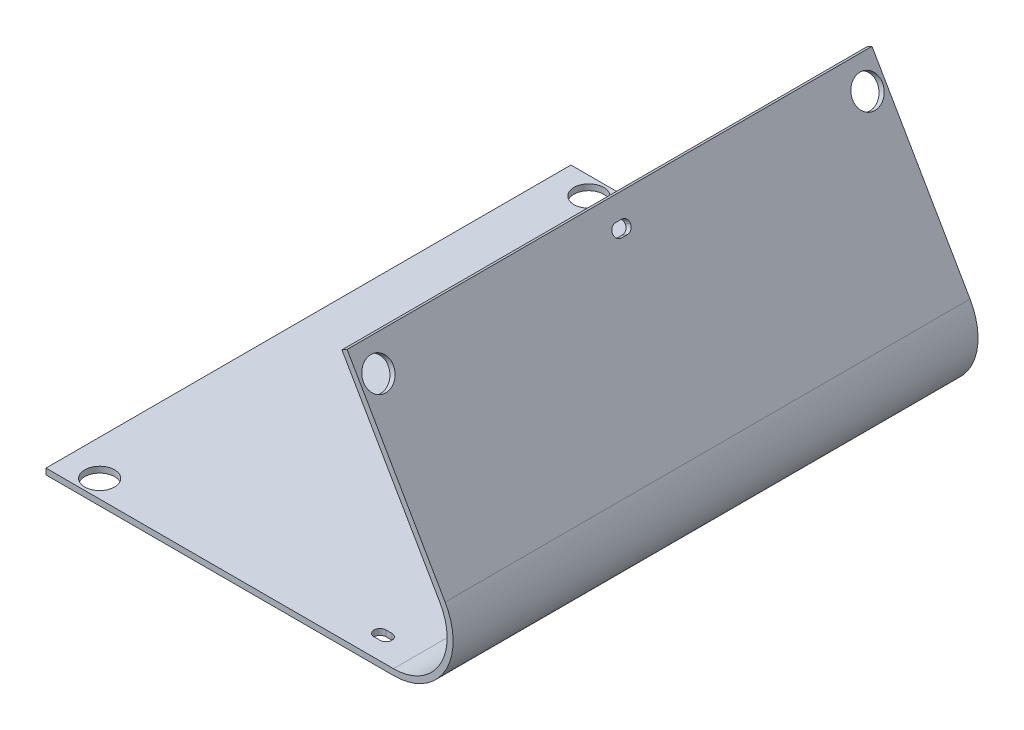
ISO-10303-21;
HEADER;
FILE_DESCRIPTION(('STEP AP214'),'2;1');
FILE_NAME('part.step','',(''),(''),'','','');
FILE_SCHEMA(('AUTOMOTIVE_DESIGN { 1 0 10303 214 1 1 1 1 }'));
ENDSEC;
DATA;
#1=APPLICATION_CONTEXT('core data for automotive mechanical design processes');
#2=APPLICATION_PROTOCOL_DEFINITION('international standard','automotive_design',2000,#1);
#3=PRODUCT_CONTEXT('',#1,'mechanical');
#4=PRODUCT('Part','Part','',(#3));
#5=PRODUCT_RELATED_PRODUCT_CATEGORY('part','',(#4));
#6=PRODUCT_DEFINITION_FORMATION('','',#4);
#7=PRODUCT_DEFINITION_CONTEXT('part definition',#1,'design');
#8=PRODUCT_DEFINITION('design','',#6,#7);
#9=PRODUCT_DEFINITION_SHAPE('','',#8);
#10=(LENGTH_UNIT() NAMED_UNIT(*) SI_UNIT(.MILLI.,.METRE.));
#11=(NAMED_UNIT(*) PLANE_ANGLE_UNIT() SI_UNIT($,.RADIAN.));
#12=(NAMED_UNIT(*) SI_UNIT($,.STERADIAN.) SOLID_ANGLE_UNIT());
#13=UNCERTAINTY_MEASURE_WITH_UNIT(LENGTH_MEASURE(1.E-05),#10,'distance_accuracy_value','');
#14=(GEOMETRIC_REPRESENTATION_CONTEXT(3) GLOBAL_UNCERTAINTY_ASSIGNED_CONTEXT((#13)) GLOBAL_UNIT_ASSIGNED_CONTEXT((#10,
#11,#12)) REPRESENTATION_CONTEXT('',''));
#15=CARTESIAN_POINT('',(0.,0.,0.));
#16=DIRECTION('',(0.,0.,1.));
#17=DIRECTION('',(1.,0.,0.));
#18=AXIS2_PLACEMENT_3D('',#15,#16,#17);
#19=CARTESIAN_POINT('',(-29.125,1.,88.));
#20=DIRECTION('',(1.,0.,0.));
#21=DIRECTION('',(0.,0.,-1.));
#22=AXIS2_PLACEMENT_3D('',#19,#20,#21);
#23=PLANE('',#22);
#24=DIRECTION('',(0.,-1.,0.));
#25=VECTOR('',#24,1.);
#26=CARTESIAN_POINT('',(-29.125,1.,0.));
#27=LINE('',#26,#25);
#28=CARTESIAN_POINT('',(-29.125,1.,0.));
#29=VERTEX_POINT('',#28);
#30=CARTESIAN_POINT('',(-29.125,0.,0.));
#31=VERTEX_POINT('',#30);
#32=EDGE_CURVE('E230',#29,#31,#27,.T.);
#33=ORIENTED_EDGE('',*,*,#32,.T.);
#34=DIRECTION('',(0.,0.,-1.));
#35=VECTOR('',#34,1.);
#36=CARTESIAN_POINT('',(-29.125,0.,88.));
#37=LINE('',#36,#35);
#38=CARTESIAN_POINT('',(-29.125,0.,88.));
#39=VERTEX_POINT('',#38);
#40=EDGE_CURVE('E211',#39,#31,#37,.T.);
#41=ORIENTED_EDGE('',*,*,#40,.F.);
#42=DIRECTION('',(0.,-1.,0.));
#43=VECTOR('',#42,1.);
#44=CARTESIAN_POINT('',(-29.125,1.,88.));
#45=LINE('',#44,#43);
#46=CARTESIAN_POINT('',(-29.125,1.,88.));
#47=VERTEX_POINT('',#46);
#48=EDGE_CURVE('E218',#47,#39,#45,.T.);
#49=ORIENTED_EDGE('',*,*,#48,.F.);
#50=DIRECTION('',(0.,0.,-1.));
#51=VECTOR('',#50,1.);
#52=CARTESIAN_POINT('',(-29.125,1.,88.));
#53=LINE('',#52,#51);
#54=EDGE_CURVE('E411',#47,#29,#53,.T.);
#55=ORIENTED_EDGE('',*,*,#54,.T.);
#56=EDGE_LOOP('',(#33,#41,#49,#55));
#57=FACE_BOUND('',#56,.T.);
#58=ADVANCED_FACE('F33',(#57),#23,.F.);
#59=CARTESIAN_POINT('',(-29.125,0.,88.));
#60=DIRECTION('',(0.,1.,0.));
#61=DIRECTION('',(0.,0.,1.));
#62=AXIS2_PLACEMENT_3D('',#59,#60,#61);
#63=PLANE('',#62);
#64=DIRECTION('',(1.,0.,0.));
#65=VECTOR('',#64,1.);
#66=CARTESIAN_POINT('',(21.875,0.,83.));
#67=LINE('',#66,#65);
#68=CARTESIAN_POINT('',(22.875,0.,83.));
#69=VERTEX_POINT('',#68);
#70=CARTESIAN_POINT('',(23.875,0.,83.));
#71=VERTEX_POINT('',#70);
#72=EDGE_CURVE('E366',#69,#71,#67,.T.);
#73=ORIENTED_EDGE('',*,*,#72,.F.);
#74=CARTESIAN_POINT('',(22.875,0.,84.));
#75=DIRECTION('',(0.,1.,0.));
#76=DIRECTION('',(0.,0.,1.));
#77=AXIS2_PLACEMENT_3D('',#74,#75,#76);
#78=CIRCLE('',#77,1.);
#79=CARTESIAN_POINT('',(21.875,0.,84.));
#80=VERTEX_POINT('',#79);
#81=EDGE_CURVE('E280',#69,#80,#78,.T.);
#82=ORIENTED_EDGE('',*,*,#81,.T.);
#83=CARTESIAN_POINT('',(22.875,0.,84.));
#84=DIRECTION('',(0.,1.,0.));
#85=DIRECTION('',(0.,0.,1.));
#86=AXIS2_PLACEMENT_3D('',#83,#84,#85);
#87=CIRCLE('',#86,1.);
#88=CARTESIAN_POINT('',(22.875,0.,85.));
#89=VERTEX_POINT('',#88);
#90=EDGE_CURVE('E268',#80,#89,#87,.T.);
#91=ORIENTED_EDGE('',*,*,#90,.T.);
#92=DIRECTION('',(-1.,0.,0.));
#93=VECTOR('',#92,1.);
#94=CARTESIAN_POINT('',(21.875,0.,85.));
#95=LINE('',#94,#93);
#96=CARTESIAN_POINT('',(23.875,0.,85.));
#97=VERTEX_POINT('',#96);
#98=EDGE_CURVE('E376',#97,#89,#95,.T.);
#99=ORIENTED_EDGE('',*,*,#98,.F.);
#100=CARTESIAN_POINT('',(23.875,0.,84.));
#101=DIRECTION('',(0.,1.,0.));
#102=DIRECTION('',(0.,0.,1.));
#103=AXIS2_PLACEMENT_3D('',#100,#101,#102);
#104=CIRCLE('',#103,1.);
#105=CARTESIAN_POINT('',(24.875,0.,84.));
#106=VERTEX_POINT('',#105);
#107=EDGE_CURVE('E276',#97,#106,#104,.T.);
#108=ORIENTED_EDGE('',*,*,#107,.T.);
#109=CARTESIAN_POINT('',(23.875,0.,84.));
#110=DIRECTION('',(0.,1.,0.));
#111=DIRECTION('',(0.,0.,1.));
#112=AXIS2_PLACEMENT_3D('',#109,#110,#111);
#113=CIRCLE('',#112,1.);
#114=EDGE_CURVE('E272',#106,#71,#113,.T.);
#115=ORIENTED_EDGE('',*,*,#114,.T.);
#116=EDGE_LOOP('',(#73,#82,#91,#99,#108,#115));
#117=FACE_BOUND('',#116,.T.);
#118=CARTESIAN_POINT('',(22.875,0.,4.));
#119=DIRECTION('',(0.,1.,0.));
#120=DIRECTION('',(0.,0.,1.));
#121=AXIS2_PLACEMENT_3D('',#118,#119,#120);
#122=CIRCLE('',#121,1.);
#123=CARTESIAN_POINT('',(22.875,0.,3.));
#124=VERTEX_POINT('',#123);
#125=CARTESIAN_POINT('',(21.875,0.,4.));
#126=VERTEX_POINT('',#125);
#127=EDGE_CURVE('E284',#124,#126,#122,.T.);
#128=ORIENTED_EDGE('',*,*,#127,.T.);
#129=CARTESIAN_POINT('',(22.875,0.,4.));
#130=DIRECTION('',(0.,1.,0.));
#131=DIRECTION('',(0.,0.,1.));
#132=AXIS2_PLACEMENT_3D('',#129,#130,#131);
#133=CIRCLE('',#132,1.);
#134=CARTESIAN_POINT('',(22.875,0.,5.));
#135=VERTEX_POINT('',#134);
#136=EDGE_CURVE('E288',#126,#135,#133,.T.);
#137=ORIENTED_EDGE('',*,*,#136,.T.);
#138=DIRECTION('',(-1.,0.,0.));
#139=VECTOR('',#138,1.);
#140=CARTESIAN_POINT('',(21.875,0.,5.));
#141=LINE('',#140,#139);
#142=CARTESIAN_POINT('',(23.875,0.,5.));
#143=VERTEX_POINT('',#142);
#144=EDGE_CURVE('E382',#143,#135,#141,.T.);
#145=ORIENTED_EDGE('',*,*,#144,.F.);
#146=CARTESIAN_POINT('',(23.875,0.,4.));
#147=DIRECTION('',(0.,1.,0.));
#148=DIRECTION('',(0.,0.,1.));
#149=AXIS2_PLACEMENT_3D('',#146,#147,#148);
#150=CIRCLE('',#149,1.);
#151=CARTESIAN_POINT('',(24.875,0.,4.));
#152=VERTEX_POINT('',#151);
#153=EDGE_CURVE('E296',#143,#152,#150,.T.);
#154=ORIENTED_EDGE('',*,*,#153,.T.);
#155=CARTESIAN_POINT('',(23.875,0.,4.));
#156=DIRECTION('',(0.,1.,0.));
#157=DIRECTION('',(0.,0.,1.));
#158=AXIS2_PLACEMENT_3D('',#155,#156,#157);
#159=CIRCLE('',#158,1.);
#160=CARTESIAN_POINT('',(23.875,0.,3.));
#161=VERTEX_POINT('',#160);
#162=EDGE_CURVE('E292',#152,#161,#159,.T.);
#163=ORIENTED_EDGE('',*,*,#162,.T.);
#164=DIRECTION('',(1.,0.,0.));
#165=VECTOR('',#164,1.);
#166=CARTESIAN_POINT('',(21.875,0.,3.));
#167=LINE('',#166,#165);
#168=EDGE_CURVE('E361',#124,#161,#167,.T.);
#169=ORIENTED_EDGE('',*,*,#168,.F.);
#170=EDGE_LOOP('',(#128,#137,#145,#154,#163,#169));
#171=FACE_BOUND('',#170,.T.);
#172=CARTESIAN_POINT('',(-23.125,0.,3.));
#173=DIRECTION('',(0.,1.,0.));
#174=DIRECTION('',(0.,0.,1.));
#175=AXIS2_PLACEMENT_3D('',#172,#173,#174);
#176=CIRCLE('',#175,2.49999999999999);
#177=CARTESIAN_POINT('',(-23.125,0.,5.49999999999999));
#178=VERTEX_POINT('',#177);
#179=EDGE_CURVE('E390',#178,#178,#176,.T.);
#180=ORIENTED_EDGE('',*,*,#179,.T.);
#181=EDGE_LOOP('',(#180));
#182=FACE_BOUND('',#181,.T.);
#183=CARTESIAN_POINT('',(-23.125,0.,85.));
#184=DIRECTION('',(0.,1.,0.));
#185=DIRECTION('',(0.,0.,-1.));
#186=AXIS2_PLACEMENT_3D('',#183,#184,#185);
#187=CIRCLE('',#186,2.5);
#188=CARTESIAN_POINT('',(-23.125,0.,82.5));
#189=VERTEX_POINT('',#188);
#190=EDGE_CURVE('E396',#189,#189,#187,.T.);
#191=ORIENTED_EDGE('',*,*,#190,.T.);
#192=EDGE_LOOP('',(#191));
#193=FACE_BOUND('',#192,.T.);
#194=DIRECTION('',(1.,0.,0.));
#195=VECTOR('',#194,1.);
#196=CARTESIAN_POINT('',(-29.125,0.,0.));
#197=LINE('',#196,#195);
#198=CARTESIAN_POINT('',(29.125,0.,0.));
#199=VERTEX_POINT('',#198);
#200=EDGE_CURVE('E413',#31,#199,#197,.T.);
#201=ORIENTED_EDGE('',*,*,#200,.T.);
#202=DIRECTION('',(0.,0.,-1.));
#203=VECTOR('',#202,1.);
#204=CARTESIAN_POINT('',(29.125,0.,88.));
#205=LINE('',#204,#203);
#206=CARTESIAN_POINT('',(29.125,0.,88.));
#207=VERTEX_POINT('',#206);
#208=EDGE_CURVE('E214',#207,#199,#205,.T.);
#209=ORIENTED_EDGE('',*,*,#208,.F.);
#210=DIRECTION('',(1.,0.,0.));
#211=VECTOR('',#210,1.);
#212=CARTESIAN_POINT('',(-29.125,0.,88.));
#213=LINE('',#212,#211);
#214=EDGE_CURVE('E207',#39,#207,#213,.T.);
#215=ORIENTED_EDGE('',*,*,#214,.F.);
#216=ORIENTED_EDGE('',*,*,#40,.T.);
#217=EDGE_LOOP('',(#201,#209,#215,#216));
#218=FACE_BOUND('',#217,.T.);
#219=ADVANCED_FACE('F209',(#117,#171,#182,#193,#218),#63,.F.);
#220=CARTESIAN_POINT('',(29.125,10.,88.));
#221=DIRECTION('',(0.,0.,-1.));
#222=DIRECTION('',(-1.,0.,0.));
#223=AXIS2_PLACEMENT_3D('',#220,#221,#222);
#224=CYLINDRICAL_SURFACE('',#223,10.);
#225=CARTESIAN_POINT('',(29.125,10.,0.));
#226=DIRECTION('',(0.,0.,1.));
#227=DIRECTION('',(1.,0.,0.));
#228=AXIS2_PLACEMENT_3D('',#225,#226,#227);
#229=CIRCLE('',#228,10.);
#230=CARTESIAN_POINT('',(37.7852540378444,15.,0.));
#231=VERTEX_POINT('',#230);
#232=EDGE_CURVE('E415',#199,#231,#229,.T.);
#233=ORIENTED_EDGE('',*,*,#232,.T.);
#234=DIRECTION('',(0.,0.,-1.));
#235=VECTOR('',#234,1.);
#236=CARTESIAN_POINT('',(37.7852540378444,15.,88.));
#237=LINE('',#236,#235);
#238=CARTESIAN_POINT('',(37.7852540378444,15.,88.));
#239=VERTEX_POINT('',#238);
#240=EDGE_CURVE('E235',#239,#231,#237,.T.);
#241=ORIENTED_EDGE('',*,*,#240,.F.);
#242=CARTESIAN_POINT('',(29.125,10.,88.));
#243=DIRECTION('',(0.,0.,1.));
#244=DIRECTION('',(1.,0.,0.));
#245=AXIS2_PLACEMENT_3D('',#242,#243,#244);
#246=CIRCLE('',#245,10.);
#247=EDGE_CURVE('E217',#207,#239,#246,.T.);
#248=ORIENTED_EDGE('',*,*,#247,.F.);
#249=ORIENTED_EDGE('',*,*,#208,.T.);
#250=EDGE_LOOP('',(#233,#241,#248,#249));
#251=FACE_BOUND('',#250,.T.);
#252=ADVANCED_FACE('F461',(#251),#224,.T.);
#253=CARTESIAN_POINT('',(37.7852540378444,15.,88.));
#254=DIRECTION('',(-0.866025403784436,-0.500000000000004,0.));
#255=DIRECTION('',(0.500000000000004,-0.866025403784436,0.));
#256=AXIS2_PLACEMENT_3D('',#253,#254,#255);
#257=PLANE('',#256);
#258=DIRECTION('',(0.,0.,-1.));
#259=VECTOR('',#258,1.);
#260=CARTESIAN_POINT('',(23.8502540378442,39.1361280034723,45.5));
#261=LINE('',#260,#259);
#262=CARTESIAN_POINT('',(23.8502540378442,39.1361280034723,44.5));
#263=VERTEX_POINT('',#262);
#264=CARTESIAN_POINT('',(23.8502540378442,39.1361280034723,43.5));
#265=VERTEX_POINT('',#264);
#266=EDGE_CURVE('E313',#263,#265,#261,.T.);
#267=ORIENTED_EDGE('',*,*,#266,.F.);
#268=CARTESIAN_POINT('',(23.3502540378442,40.0021534072567,44.5));
#269=DIRECTION('',(-0.866025403784436,-0.500000000000004,0.));
#270=DIRECTION('',(0.500000000000004,-0.866025403784436,0.));
#271=AXIS2_PLACEMENT_3D('',#268,#269,#270);
#272=CIRCLE('',#271,1.);
#273=CARTESIAN_POINT('',(23.3502540378442,40.0021534072567,45.5));
#274=VERTEX_POINT('',#273);
#275=EDGE_CURVE('E11',#263,#274,#272,.T.);
#276=ORIENTED_EDGE('',*,*,#275,.T.);
#277=CARTESIAN_POINT('',(23.3502540378442,40.0021534072567,44.5));
#278=DIRECTION('',(-0.866025403784436,-0.500000000000004,0.));
#279=DIRECTION('',(0.500000000000004,-0.866025403784436,0.));
#280=AXIS2_PLACEMENT_3D('',#277,#278,#279);
#281=CIRCLE('',#280,1.);
#282=CARTESIAN_POINT('',(22.8502540378442,40.8681788110412,44.5));
#283=VERTEX_POINT('',#282);
#284=EDGE_CURVE('E307',#274,#283,#281,.T.);
#285=ORIENTED_EDGE('',*,*,#284,.T.);
#286=DIRECTION('',(0.,0.,1.));
#287=VECTOR('',#286,1.);
#288=CARTESIAN_POINT('',(22.8502540378442,40.8681788110412,45.5));
#289=LINE('',#288,#287);
#290=CARTESIAN_POINT('',(22.8502540378442,40.8681788110412,43.5));
#291=VERTEX_POINT('',#290);
#292=EDGE_CURVE('E344',#291,#283,#289,.T.);
#293=ORIENTED_EDGE('',*,*,#292,.F.);
#294=CARTESIAN_POINT('',(23.3502540378442,40.0021534072567,43.5));
#295=DIRECTION('',(-0.866025403784436,-0.500000000000004,0.));
#296=DIRECTION('',(0.500000000000004,-0.866025403784436,0.));
#297=AXIS2_PLACEMENT_3D('',#294,#295,#296);
#298=CIRCLE('',#297,1.);
#299=CARTESIAN_POINT('',(23.3502540378442,40.0021534072567,42.5));
#300=VERTEX_POINT('',#299);
#301=EDGE_CURVE('E300',#291,#300,#298,.T.);
#302=ORIENTED_EDGE('',*,*,#301,.T.);
#303=CARTESIAN_POINT('',(23.3502540378442,40.0021534072567,43.5));
#304=DIRECTION('',(-0.866025403784436,-0.500000000000004,0.));
#305=DIRECTION('',(0.500000000000004,-0.866025403784436,0.));
#306=AXIS2_PLACEMENT_3D('',#303,#304,#305);
#307=CIRCLE('',#306,1.);
#308=EDGE_CURVE('E304',#300,#265,#307,.T.);
#309=ORIENTED_EDGE('',*,*,#308,.T.);
#310=EDGE_LOOP('',(#267,#276,#285,#293,#302,#309));
#311=FACE_BOUND('',#310,.T.);
#312=CARTESIAN_POINT('',(23.6019191624431,39.5662566249584,85.));
#313=DIRECTION('',(-0.866025403784436,-0.500000000000004,0.));
#314=DIRECTION('',(0.500000000000004,-0.866025403784436,0.));
#315=AXIS2_PLACEMENT_3D('',#312,#313,#314);
#316=CIRCLE('',#315,2.5);
#317=CARTESIAN_POINT('',(24.8519191624431,37.4011931154973,85.));
#318=VERTEX_POINT('',#317);
#319=EDGE_CURVE('E357',#318,#318,#316,.F.);
#320=ORIENTED_EDGE('',*,*,#319,.F.);
#321=EDGE_LOOP('',(#320));
#322=FACE_BOUND('',#321,.T.);
#323=CARTESIAN_POINT('',(23.6019191624431,39.5662566249584,3.));
#324=DIRECTION('',(-0.866025403784436,-0.500000000000004,0.));
#325=DIRECTION('',(0.500000000000004,-0.866025403784436,0.));
#326=AXIS2_PLACEMENT_3D('',#323,#324,#325);
#327=CIRCLE('',#326,2.5);
#328=CARTESIAN_POINT('',(24.8519191624431,37.4011931154973,3.));
#329=VERTEX_POINT('',#328);
#330=EDGE_CURVE('E358',#329,#329,#327,.F.);
#331=ORIENTED_EDGE('',*,*,#330,.F.);
#332=EDGE_LOOP('',(#331));
#333=FACE_BOUND('',#332,.T.);
#334=DIRECTION('',(-0.500000000000004,0.866025403784436,0.));
#335=VECTOR('',#334,1.);
#336=CARTESIAN_POINT('',(37.7852540378444,15.,0.));
#337=LINE('',#336,#335);
#338=CARTESIAN_POINT('',(21.3502540378442,43.4662550223945,0.));
#339=VERTEX_POINT('',#338);
#340=EDGE_CURVE('E417',#231,#339,#337,.T.);
#341=ORIENTED_EDGE('',*,*,#340,.T.);
#342=DIRECTION('',(0.,0.,-1.));
#343=VECTOR('',#342,1.);
#344=CARTESIAN_POINT('',(21.3502540378442,43.4662550223945,88.));
#345=LINE('',#344,#343);
#346=CARTESIAN_POINT('',(21.3502540378442,43.4662550223945,88.));
#347=VERTEX_POINT('',#346);
#348=EDGE_CURVE('E436',#347,#339,#345,.T.);
#349=ORIENTED_EDGE('',*,*,#348,.F.);
#350=DIRECTION('',(-0.500000000000004,0.866025403784436,0.));
#351=VECTOR('',#350,1.);
#352=CARTESIAN_POINT('',(37.7852540378444,15.,88.));
#353=LINE('',#352,#351);
#354=EDGE_CURVE('E402',#239,#347,#353,.T.);
#355=ORIENTED_EDGE('',*,*,#354,.F.);
#356=ORIENTED_EDGE('',*,*,#240,.T.);
#357=EDGE_LOOP('',(#341,#349,#355,#356));
#358=FACE_BOUND('',#357,.T.);
#359=ADVANCED_FACE('F443',(#311,#322,#333,#358),#257,.F.);
#360=CARTESIAN_POINT('',(21.3502540378442,43.4662550223945,88.));
#361=DIRECTION('',(0.500000000000001,-0.866025403784438,0.));
#362=DIRECTION('',(0.866025403784438,0.500000000000001,0.));
#363=AXIS2_PLACEMENT_3D('',#360,#361,#362);
#364=PLANE('',#363);
#365=DIRECTION('',(-0.866025403784438,-0.500000000000001,0.));
#366=VECTOR('',#365,1.);
#367=CARTESIAN_POINT('',(21.3502540378442,43.4662550223945,0.));
#368=LINE('',#367,#366);
#369=CARTESIAN_POINT('',(20.48422863406,42.9662550223946,0.));
#370=VERTEX_POINT('',#369);
#371=EDGE_CURVE('E419',#339,#370,#368,.T.);
#372=ORIENTED_EDGE('',*,*,#371,.T.);
#373=DIRECTION('',(0.,0.,-1.));
#374=VECTOR('',#373,1.);
#375=CARTESIAN_POINT('',(20.48422863406,42.9662550223946,88.));
#376=LINE('',#375,#374);
#377=CARTESIAN_POINT('',(20.48422863406,42.9662550223946,88.));
#378=VERTEX_POINT('',#377);
#379=EDGE_CURVE('E433',#378,#370,#376,.T.);
#380=ORIENTED_EDGE('',*,*,#379,.F.);
#381=DIRECTION('',(-0.866025403784438,-0.500000000000001,0.));
#382=VECTOR('',#381,1.);
#383=CARTESIAN_POINT('',(21.3502540378442,43.4662550223945,88.));
#384=LINE('',#383,#382);
#385=EDGE_CURVE('E404',#347,#378,#384,.T.);
#386=ORIENTED_EDGE('',*,*,#385,.F.);
#387=ORIENTED_EDGE('',*,*,#348,.T.);
#388=EDGE_LOOP('',(#372,#380,#386,#387));
#389=FACE_BOUND('',#388,.T.);
#390=ADVANCED_FACE('F454',(#389),#364,.F.);
#391=CARTESIAN_POINT('',(36.91922863406,14.5000000000001,88.));
#392=DIRECTION('',(0.866025403784439,0.5,0.));
#393=DIRECTION('',(-0.5,0.866025403784439,0.));
#394=AXIS2_PLACEMENT_3D('',#391,#392,#393);
#395=PLANE('',#394);
#396=CARTESIAN_POINT('',(22.48422863406,39.5021534072568,44.5));
#397=DIRECTION('',(0.866025403784439,0.5,0.));
#398=DIRECTION('',(-0.5,0.866025403784439,0.));
#399=AXIS2_PLACEMENT_3D('',#396,#397,#398);
#400=CIRCLE('',#399,1.);
#401=CARTESIAN_POINT('',(21.98422863406,40.3681788110413,44.5));
#402=VERTEX_POINT('',#401);
#403=CARTESIAN_POINT('',(22.48422863406,39.5021534072568,45.5));
#404=VERTEX_POINT('',#403);
#405=EDGE_CURVE('E56',#402,#404,#400,.T.);
#406=ORIENTED_EDGE('',*,*,#405,.T.);
#407=CARTESIAN_POINT('',(22.48422863406,39.5021534072568,44.5));
#408=DIRECTION('',(0.866025403784439,0.5,0.));
#409=DIRECTION('',(-0.5,0.866025403784439,0.));
#410=AXIS2_PLACEMENT_3D('',#407,#408,#409);
#411=CIRCLE('',#410,1.);
#412=CARTESIAN_POINT('',(22.98422863406,38.6361280034724,44.5));
#413=VERTEX_POINT('',#412);
#414=EDGE_CURVE('E42',#404,#413,#411,.T.);
#415=ORIENTED_EDGE('',*,*,#414,.T.);
#416=DIRECTION('',(0.,0.,1.));
#417=VECTOR('',#416,1.);
#418=CARTESIAN_POINT('',(22.98422863406,38.6361280034724,45.5));
#419=LINE('',#418,#417);
#420=CARTESIAN_POINT('',(22.98422863406,38.6361280034724,43.5));
#421=VERTEX_POINT('',#420);
#422=EDGE_CURVE('E338',#421,#413,#419,.T.);
#423=ORIENTED_EDGE('',*,*,#422,.F.);
#424=CARTESIAN_POINT('',(22.48422863406,39.5021534072568,43.5));
#425=DIRECTION('',(0.866025403784439,0.5,0.));
#426=DIRECTION('',(-0.5,0.866025403784439,0.));
#427=AXIS2_PLACEMENT_3D('',#424,#425,#426);
#428=CIRCLE('',#427,1.);
#429=CARTESIAN_POINT('',(22.48422863406,39.5021534072568,42.5));
#430=VERTEX_POINT('',#429);
#431=EDGE_CURVE('E302',#421,#430,#428,.T.);
#432=ORIENTED_EDGE('',*,*,#431,.T.);
#433=CARTESIAN_POINT('',(22.48422863406,39.5021534072568,43.5));
#434=DIRECTION('',(0.866025403784439,0.5,0.));
#435=DIRECTION('',(-0.5,0.866025403784439,0.));
#436=AXIS2_PLACEMENT_3D('',#433,#434,#435);
#437=CIRCLE('',#436,1.);
#438=CARTESIAN_POINT('',(21.98422863406,40.3681788110413,43.5));
#439=VERTEX_POINT('',#438);
#440=EDGE_CURVE('E298',#430,#439,#437,.T.);
#441=ORIENTED_EDGE('',*,*,#440,.T.);
#442=DIRECTION('',(0.,0.,-1.));
#443=VECTOR('',#442,1.);
#444=CARTESIAN_POINT('',(21.98422863406,40.3681788110413,45.5));
#445=LINE('',#444,#443);
#446=EDGE_CURVE('E345',#402,#439,#445,.T.);
#447=ORIENTED_EDGE('',*,*,#446,.F.);
#448=EDGE_LOOP('',(#406,#415,#423,#432,#441,#447));
#449=FACE_BOUND('',#448,.T.);
#450=CARTESIAN_POINT('',(22.7358937586589,39.0662566249585,85.));
#451=DIRECTION('',(-0.866025403784439,-0.5,0.));
#452=DIRECTION('',(0.5,-0.866025403784439,0.));
#453=AXIS2_PLACEMENT_3D('',#450,#451,#452);
#454=CIRCLE('',#453,2.5);
#455=CARTESIAN_POINT('',(23.9858937586589,36.9011931154974,85.));
#456=VERTEX_POINT('',#455);
#457=EDGE_CURVE('E354',#456,#456,#454,.T.);
#458=ORIENTED_EDGE('',*,*,#457,.F.);
#459=EDGE_LOOP('',(#458));
#460=FACE_BOUND('',#459,.T.);
#461=CARTESIAN_POINT('',(22.7358937586589,39.0662566249585,3.));
#462=DIRECTION('',(-0.866025403784439,-0.5,0.));
#463=DIRECTION('',(-0.5,0.866025403784439,0.));
#464=AXIS2_PLACEMENT_3D('',#461,#462,#463);
#465=CIRCLE('',#464,2.5);
#466=CARTESIAN_POINT('',(21.4858937586589,41.2313201344196,3.));
#467=VERTEX_POINT('',#466);
#468=EDGE_CURVE('E348',#467,#467,#465,.T.);
#469=ORIENTED_EDGE('',*,*,#468,.F.);
#470=EDGE_LOOP('',(#469));
#471=FACE_BOUND('',#470,.T.);
#472=DIRECTION('',(0.5,-0.866025403784439,0.));
#473=VECTOR('',#472,1.);
#474=CARTESIAN_POINT('',(36.91922863406,14.5000000000001,0.));
#475=LINE('',#474,#473);
#476=CARTESIAN_POINT('',(36.91922863406,14.5000000000001,0.));
#477=VERTEX_POINT('',#476);
#478=EDGE_CURVE('E421',#370,#477,#475,.T.);
#479=ORIENTED_EDGE('',*,*,#478,.T.);
#480=DIRECTION('',(0.,0.,-1.));
#481=VECTOR('',#480,1.);
#482=CARTESIAN_POINT('',(36.91922863406,14.5000000000001,88.));
#483=LINE('',#482,#481);
#484=CARTESIAN_POINT('',(36.91922863406,14.5000000000001,88.));
#485=VERTEX_POINT('',#484);
#486=EDGE_CURVE('E430',#485,#477,#483,.T.);
#487=ORIENTED_EDGE('',*,*,#486,.F.);
#488=DIRECTION('',(0.5,-0.866025403784439,0.));
#489=VECTOR('',#488,1.);
#490=CARTESIAN_POINT('',(36.91922863406,14.5000000000001,88.));
#491=LINE('',#490,#489);
#492=EDGE_CURVE('E406',#378,#485,#491,.T.);
#493=ORIENTED_EDGE('',*,*,#492,.F.);
#494=ORIENTED_EDGE('',*,*,#379,.T.);
#495=EDGE_LOOP('',(#479,#487,#493,#494));
#496=FACE_BOUND('',#495,.T.);
#497=ADVANCED_FACE('F336',(#449,#460,#471,#496),#395,.F.);
#498=CARTESIAN_POINT('',(29.125,10.0000000000001,88.));
#499=DIRECTION('',(0.,0.,-1.));
#500=DIRECTION('',(-1.,0.,0.));
#501=AXIS2_PLACEMENT_3D('',#498,#499,#500);
#502=CYLINDRICAL_SURFACE('',#501,9.00000000000007);
#503=CARTESIAN_POINT('',(29.125,10.0000000000001,0.));
#504=DIRECTION('',(0.,0.,-1.));
#505=DIRECTION('',(1.,0.,0.));
#506=AXIS2_PLACEMENT_3D('',#503,#504,#505);
#507=CIRCLE('',#506,9.00000000000007);
#508=CARTESIAN_POINT('',(29.125,1.,0.));
#509=VERTEX_POINT('',#508);
#510=EDGE_CURVE('E423',#477,#509,#507,.T.);
#511=ORIENTED_EDGE('',*,*,#510,.T.);
#512=DIRECTION('',(0.,0.,-1.));
#513=VECTOR('',#512,1.);
#514=CARTESIAN_POINT('',(29.125,1.,88.));
#515=LINE('',#514,#513);
#516=CARTESIAN_POINT('',(29.125,1.,88.));
#517=VERTEX_POINT('',#516);
#518=EDGE_CURVE('E427',#517,#509,#515,.T.);
#519=ORIENTED_EDGE('',*,*,#518,.F.);
#520=CARTESIAN_POINT('',(29.125,10.0000000000001,88.));
#521=DIRECTION('',(0.,0.,-1.));
#522=DIRECTION('',(1.,0.,0.));
#523=AXIS2_PLACEMENT_3D('',#520,#521,#522);
#524=CIRCLE('',#523,9.00000000000007);
#525=EDGE_CURVE('E408',#485,#517,#524,.T.);
#526=ORIENTED_EDGE('',*,*,#525,.F.);
#527=ORIENTED_EDGE('',*,*,#486,.T.);
#528=EDGE_LOOP('',(#511,#519,#526,#527));
#529=FACE_BOUND('',#528,.T.);
#530=ADVANCED_FACE('F659',(#529),#502,.F.);
#531=CARTESIAN_POINT('',(-29.125,1.,88.));
#532=DIRECTION('',(0.,-1.,0.));
#533=DIRECTION('',(0.,0.,-1.));
#534=AXIS2_PLACEMENT_3D('',#531,#532,#533);
#535=PLANE('',#534);
#536=CARTESIAN_POINT('',(22.875,1.,84.));
#537=DIRECTION('',(0.,-1.,0.));
#538=DIRECTION('',(0.,0.,-1.));
#539=AXIS2_PLACEMENT_3D('',#536,#537,#538);
#540=CIRCLE('',#539,1.);
#541=CARTESIAN_POINT('',(22.875,1.,85.));
#542=VERTEX_POINT('',#541);
#543=CARTESIAN_POINT('',(21.875,1.,84.));
#544=VERTEX_POINT('',#543);
#545=EDGE_CURVE('E266',#542,#544,#540,.T.);
#546=ORIENTED_EDGE('',*,*,#545,.T.);
#547=CARTESIAN_POINT('',(22.875,1.,84.));
#548=DIRECTION('',(0.,-1.,0.));
#549=DIRECTION('',(0.,0.,-1.));
#550=AXIS2_PLACEMENT_3D('',#547,#548,#549);
#551=CIRCLE('',#550,1.);
#552=CARTESIAN_POINT('',(22.875,1.,83.));
#553=VERTEX_POINT('',#552);
#554=EDGE_CURVE('E278',#544,#553,#551,.T.);
#555=ORIENTED_EDGE('',*,*,#554,.T.);
#556=DIRECTION('',(-1.,0.,0.));
#557=VECTOR('',#556,1.);
#558=CARTESIAN_POINT('',(21.875,1.,83.));
#559=LINE('',#558,#557);
#560=CARTESIAN_POINT('',(23.875,1.,83.));
#561=VERTEX_POINT('',#560);
#562=EDGE_CURVE('E373',#561,#553,#559,.T.);
#563=ORIENTED_EDGE('',*,*,#562,.F.);
#564=CARTESIAN_POINT('',(23.875,1.,84.));
#565=DIRECTION('',(0.,-1.,0.));
#566=DIRECTION('',(0.,0.,-1.));
#567=AXIS2_PLACEMENT_3D('',#564,#565,#566);
#568=CIRCLE('',#567,1.);
#569=CARTESIAN_POINT('',(24.875,1.,84.));
#570=VERTEX_POINT('',#569);
#571=EDGE_CURVE('E270',#561,#570,#568,.T.);
#572=ORIENTED_EDGE('',*,*,#571,.T.);
#573=CARTESIAN_POINT('',(23.875,1.,84.));
#574=DIRECTION('',(0.,-1.,0.));
#575=DIRECTION('',(0.,0.,-1.));
#576=AXIS2_PLACEMENT_3D('',#573,#574,#575);
#577=CIRCLE('',#576,1.);
#578=CARTESIAN_POINT('',(23.875,1.,85.));
#579=VERTEX_POINT('',#578);
#580=EDGE_CURVE('E274',#570,#579,#577,.T.);
#581=ORIENTED_EDGE('',*,*,#580,.T.);
#582=DIRECTION('',(1.,0.,0.));
#583=VECTOR('',#582,1.);
#584=CARTESIAN_POINT('',(21.875,1.,85.));
#585=LINE('',#584,#583);
#586=EDGE_CURVE('E369',#542,#579,#585,.T.);
#587=ORIENTED_EDGE('',*,*,#586,.F.);
#588=EDGE_LOOP('',(#546,#555,#563,#572,#581,#587));
#589=FACE_BOUND('',#588,.T.);
#590=CARTESIAN_POINT('',(23.875,1.,4.));
#591=DIRECTION('',(0.,-1.,0.));
#592=DIRECTION('',(0.,0.,-1.));
#593=AXIS2_PLACEMENT_3D('',#590,#591,#592);
#594=CIRCLE('',#593,1.);
#595=CARTESIAN_POINT('',(23.875,1.,3.));
#596=VERTEX_POINT('',#595);
#597=CARTESIAN_POINT('',(24.875,1.,4.));
#598=VERTEX_POINT('',#597);
#599=EDGE_CURVE('E290',#596,#598,#594,.T.);
#600=ORIENTED_EDGE('',*,*,#599,.T.);
#601=CARTESIAN_POINT('',(23.875,1.,4.));
#602=DIRECTION('',(0.,-1.,0.));
#603=DIRECTION('',(0.,0.,-1.));
#604=AXIS2_PLACEMENT_3D('',#601,#602,#603);
#605=CIRCLE('',#604,1.);
#606=CARTESIAN_POINT('',(23.875,1.,5.));
#607=VERTEX_POINT('',#606);
#608=EDGE_CURVE('E294',#598,#607,#605,.T.);
#609=ORIENTED_EDGE('',*,*,#608,.T.);
#610=DIRECTION('',(1.,0.,0.));
#611=VECTOR('',#610,1.);
#612=CARTESIAN_POINT('',(21.875,1.,5.));
#613=LINE('',#612,#611);
#614=CARTESIAN_POINT('',(22.875,1.,5.));
#615=VERTEX_POINT('',#614);
#616=EDGE_CURVE('E385',#615,#607,#613,.T.);
#617=ORIENTED_EDGE('',*,*,#616,.F.);
#618=CARTESIAN_POINT('',(22.875,1.,4.));
#619=DIRECTION('',(0.,-1.,0.));
#620=DIRECTION('',(0.,0.,-1.));
#621=AXIS2_PLACEMENT_3D('',#618,#619,#620);
#622=CIRCLE('',#621,1.);
#623=CARTESIAN_POINT('',(21.875,1.,4.));
#624=VERTEX_POINT('',#623);
#625=EDGE_CURVE('E286',#615,#624,#622,.T.);
#626=ORIENTED_EDGE('',*,*,#625,.T.);
#627=CARTESIAN_POINT('',(22.875,1.,4.));
#628=DIRECTION('',(0.,-1.,0.));
#629=DIRECTION('',(0.,0.,-1.));
#630=AXIS2_PLACEMENT_3D('',#627,#628,#629);
#631=CIRCLE('',#630,1.);
#632=CARTESIAN_POINT('',(22.875,1.,3.));
#633=VERTEX_POINT('',#632);
#634=EDGE_CURVE('E282',#624,#633,#631,.T.);
#635=ORIENTED_EDGE('',*,*,#634,.T.);
#636=DIRECTION('',(-1.,0.,0.));
#637=VECTOR('',#636,1.);
#638=CARTESIAN_POINT('',(21.875,1.,3.));
#639=LINE('',#638,#637);
#640=EDGE_CURVE('E370',#596,#633,#639,.T.);
#641=ORIENTED_EDGE('',*,*,#640,.F.);
#642=EDGE_LOOP('',(#600,#609,#617,#626,#635,#641));
#643=FACE_BOUND('',#642,.T.);
#644=CARTESIAN_POINT('',(-23.125,1.,3.));
#645=DIRECTION('',(0.,1.,0.));
#646=DIRECTION('',(0.,0.,1.));
#647=AXIS2_PLACEMENT_3D('',#644,#645,#646);
#648=CIRCLE('',#647,2.49999999999999);
#649=CARTESIAN_POINT('',(-23.125,1.,5.49999999999999));
#650=VERTEX_POINT('',#649);
#651=EDGE_CURVE('E393',#650,#650,#648,.T.);
#652=ORIENTED_EDGE('',*,*,#651,.F.);
#653=EDGE_LOOP('',(#652));
#654=FACE_BOUND('',#653,.T.);
#655=CARTESIAN_POINT('',(-23.125,1.,85.));
#656=DIRECTION('',(0.,1.,0.));
#657=DIRECTION('',(0.,0.,-1.));
#658=AXIS2_PLACEMENT_3D('',#655,#656,#657);
#659=CIRCLE('',#658,2.5);
#660=CARTESIAN_POINT('',(-23.125,1.,82.5));
#661=VERTEX_POINT('',#660);
#662=EDGE_CURVE('E379',#661,#661,#659,.T.);
#663=ORIENTED_EDGE('',*,*,#662,.F.);
#664=EDGE_LOOP('',(#663));
#665=FACE_BOUND('',#664,.T.);
#666=DIRECTION('',(-1.,0.,0.));
#667=VECTOR('',#666,1.);
#668=CARTESIAN_POINT('',(-29.125,1.,0.));
#669=LINE('',#668,#667);
#670=EDGE_CURVE('E227',#509,#29,#669,.T.);
#671=ORIENTED_EDGE('',*,*,#670,.T.);
#672=ORIENTED_EDGE('',*,*,#54,.F.);
#673=DIRECTION('',(-1.,0.,0.));
#674=VECTOR('',#673,1.);
#675=CARTESIAN_POINT('',(-29.125,1.,88.));
#676=LINE('',#675,#674);
#677=EDGE_CURVE('E223',#517,#47,#676,.T.);
#678=ORIENTED_EDGE('',*,*,#677,.F.);
#679=ORIENTED_EDGE('',*,*,#518,.T.);
#680=EDGE_LOOP('',(#671,#672,#678,#679));
#681=FACE_BOUND('',#680,.T.);
#682=ADVANCED_FACE('F652',(#589,#643,#654,#665,#681),#535,.F.);
#683=CARTESIAN_POINT('',(29.125,10.,88.));
#684=DIRECTION('',(0.,0.,1.));
#685=DIRECTION('',(1.,0.,0.));
#686=AXIS2_PLACEMENT_3D('',#683,#684,#685);
#687=PLANE('',#686);
#688=ORIENTED_EDGE('',*,*,#48,.T.);
#689=ORIENTED_EDGE('',*,*,#214,.T.);
#690=ORIENTED_EDGE('',*,*,#247,.T.);
#691=ORIENTED_EDGE('',*,*,#354,.T.);
#692=ORIENTED_EDGE('',*,*,#385,.T.);
#693=ORIENTED_EDGE('',*,*,#492,.T.);
#694=ORIENTED_EDGE('',*,*,#525,.T.);
#695=ORIENTED_EDGE('',*,*,#677,.T.);
#696=EDGE_LOOP('',(#688,#689,#690,#691,#692,#693,#694,#695));
#697=FACE_BOUND('',#696,.T.);
#698=ADVANCED_FACE('F221',(#697),#687,.T.);
#699=CARTESIAN_POINT('',(29.125,10.,0.));
#700=DIRECTION('',(0.,0.,1.));
#701=DIRECTION('',(1.,0.,0.));
#702=AXIS2_PLACEMENT_3D('',#699,#700,#701);
#703=PLANE('',#702);
#704=ORIENTED_EDGE('',*,*,#32,.F.);
#705=ORIENTED_EDGE('',*,*,#670,.F.);
#706=ORIENTED_EDGE('',*,*,#510,.F.);
#707=ORIENTED_EDGE('',*,*,#478,.F.);
#708=ORIENTED_EDGE('',*,*,#371,.F.);
#709=ORIENTED_EDGE('',*,*,#340,.F.);
#710=ORIENTED_EDGE('',*,*,#232,.F.);
#711=ORIENTED_EDGE('',*,*,#200,.F.);
#712=EDGE_LOOP('',(#704,#705,#706,#707,#708,#709,#710,#711));
#713=FACE_BOUND('',#712,.T.);
#714=ADVANCED_FACE('F449',(#713),#703,.F.);
#715=CARTESIAN_POINT('',(-23.125,0.,85.));
#716=DIRECTION('',(0.,1.,0.));
#717=DIRECTION('',(0.,0.,1.));
#718=AXIS2_PLACEMENT_3D('',#715,#716,#717);
#719=CYLINDRICAL_SURFACE('',#718,2.5);
#720=ORIENTED_EDGE('',*,*,#190,.F.);
#721=EDGE_LOOP('',(#720));
#722=FACE_BOUND('',#721,.T.);
#723=ORIENTED_EDGE('',*,*,#662,.T.);
#724=EDGE_LOOP('',(#723));
#725=FACE_BOUND('',#724,.T.);
#726=ADVANCED_FACE('F631',(#722,#725),#719,.F.);
#727=CARTESIAN_POINT('',(-23.125,0.,3.));
#728=DIRECTION('',(0.,1.,0.));
#729=DIRECTION('',(0.,0.,1.));
#730=AXIS2_PLACEMENT_3D('',#727,#728,#729);
#731=CYLINDRICAL_SURFACE('',#730,2.49999999999999);
#732=ORIENTED_EDGE('',*,*,#179,.F.);
#733=EDGE_LOOP('',(#732));
#734=FACE_BOUND('',#733,.T.);
#735=ORIENTED_EDGE('',*,*,#651,.T.);
#736=EDGE_LOOP('',(#735));
#737=FACE_BOUND('',#736,.T.);
#738=ADVANCED_FACE('F623',(#734,#737),#731,.F.);
#739=CARTESIAN_POINT('',(21.875,-0.000999999999999916,5.));
#740=DIRECTION('',(0.,0.,1.));
#741=DIRECTION('',(1.,0.,0.));
#742=AXIS2_PLACEMENT_3D('',#739,#740,#741);
#743=PLANE('',#742);
#744=ORIENTED_EDGE('',*,*,#144,.T.);
#745=DIRECTION('',(0.,1.,0.));
#746=VECTOR('',#745,1.);
#747=CARTESIAN_POINT('',(22.875,1.,5.));
#748=LINE('',#747,#746);
#749=EDGE_CURVE('E254',#135,#615,#748,.T.);
#750=ORIENTED_EDGE('',*,*,#749,.T.);
#751=ORIENTED_EDGE('',*,*,#616,.T.);
#752=DIRECTION('',(0.,1.,0.));
#753=VECTOR('',#752,1.);
#754=CARTESIAN_POINT('',(23.875,0.,5.));
#755=LINE('',#754,#753);
#756=EDGE_CURVE('E252',#607,#143,#755,.F.);
#757=ORIENTED_EDGE('',*,*,#756,.T.);
#758=EDGE_LOOP('',(#744,#750,#751,#757));
#759=FACE_BOUND('',#758,.T.);
#760=ADVANCED_FACE('F615',(#759),#743,.F.);
#761=CARTESIAN_POINT('',(21.875,-0.000999999999999916,3.));
#762=DIRECTION('',(0.,0.,-1.));
#763=DIRECTION('',(-1.,0.,0.));
#764=AXIS2_PLACEMENT_3D('',#761,#762,#763);
#765=PLANE('',#764);
#766=ORIENTED_EDGE('',*,*,#640,.T.);
#767=DIRECTION('',(0.,1.,0.));
#768=VECTOR('',#767,1.);
#769=CARTESIAN_POINT('',(22.875,0.,3.));
#770=LINE('',#769,#768);
#771=EDGE_CURVE('E249',#633,#124,#770,.F.);
#772=ORIENTED_EDGE('',*,*,#771,.T.);
#773=ORIENTED_EDGE('',*,*,#168,.T.);
#774=DIRECTION('',(0.,1.,0.));
#775=VECTOR('',#774,1.);
#776=CARTESIAN_POINT('',(23.875,1.,3.));
#777=LINE('',#776,#775);
#778=EDGE_CURVE('E246',#161,#596,#777,.T.);
#779=ORIENTED_EDGE('',*,*,#778,.T.);
#780=EDGE_LOOP('',(#766,#772,#773,#779));
#781=FACE_BOUND('',#780,.T.);
#782=ADVANCED_FACE('F607',(#781),#765,.F.);
#783=CARTESIAN_POINT('',(21.875,-0.000999999999999916,83.));
#784=DIRECTION('',(0.,0.,-1.));
#785=DIRECTION('',(-1.,0.,0.));
#786=AXIS2_PLACEMENT_3D('',#783,#784,#785);
#787=PLANE('',#786);
#788=ORIENTED_EDGE('',*,*,#72,.T.);
#789=DIRECTION('',(0.,1.,0.));
#790=VECTOR('',#789,1.);
#791=CARTESIAN_POINT('',(23.875,1.,83.));
#792=LINE('',#791,#790);
#793=EDGE_CURVE('E243',#71,#561,#792,.T.);
#794=ORIENTED_EDGE('',*,*,#793,.T.);
#795=ORIENTED_EDGE('',*,*,#562,.T.);
#796=DIRECTION('',(0.,1.,0.));
#797=VECTOR('',#796,1.);
#798=CARTESIAN_POINT('',(22.875,0.,83.));
#799=LINE('',#798,#797);
#800=EDGE_CURVE('E241',#553,#69,#799,.F.);
#801=ORIENTED_EDGE('',*,*,#800,.T.);
#802=EDGE_LOOP('',(#788,#794,#795,#801));
#803=FACE_BOUND('',#802,.T.);
#804=ADVANCED_FACE('F599',(#803),#787,.F.);
#805=CARTESIAN_POINT('',(21.875,-0.000999999999999916,85.));
#806=DIRECTION('',(0.,0.,1.));
#807=DIRECTION('',(1.,0.,0.));
#808=AXIS2_PLACEMENT_3D('',#805,#806,#807);
#809=PLANE('',#808);
#810=ORIENTED_EDGE('',*,*,#98,.T.);
#811=DIRECTION('',(0.,1.,0.));
#812=VECTOR('',#811,1.);
#813=CARTESIAN_POINT('',(22.875,1.,85.));
#814=LINE('',#813,#812);
#815=EDGE_CURVE('E233',#89,#542,#814,.T.);
#816=ORIENTED_EDGE('',*,*,#815,.T.);
#817=ORIENTED_EDGE('',*,*,#586,.T.);
#818=DIRECTION('',(0.,1.,0.));
#819=VECTOR('',#818,1.);
#820=CARTESIAN_POINT('',(23.875,0.,85.));
#821=LINE('',#820,#819);
#822=EDGE_CURVE('E231',#579,#97,#821,.F.);
#823=ORIENTED_EDGE('',*,*,#822,.T.);
#824=EDGE_LOOP('',(#810,#816,#817,#823));
#825=FACE_BOUND('',#824,.T.);
#826=ADVANCED_FACE('F591',(#825),#809,.F.);
#827=CARTESIAN_POINT('',(36.9341616467618,47.2636304121811,3.));
#828=DIRECTION('',(-0.866025403784439,-0.5,0.));
#829=DIRECTION('',(0.5,-0.866025403784439,0.));
#830=AXIS2_PLACEMENT_3D('',#827,#828,#829);
#831=CYLINDRICAL_SURFACE('',#830,2.5);
#832=ORIENTED_EDGE('',*,*,#468,.T.);
#833=EDGE_LOOP('',(#832));
#834=FACE_BOUND('',#833,.T.);
#835=ORIENTED_EDGE('',*,*,#330,.T.);
#836=EDGE_LOOP('',(#835));
#837=FACE_BOUND('',#836,.T.);
#838=ADVANCED_FACE('F582',(#834,#837),#831,.F.);
#839=CARTESIAN_POINT('',(36.9341616467618,47.2636304121811,85.));
#840=DIRECTION('',(-0.866025403784439,-0.5,0.));
#841=DIRECTION('',(0.5,-0.866025403784439,0.));
#842=AXIS2_PLACEMENT_3D('',#839,#840,#841);
#843=CYLINDRICAL_SURFACE('',#842,2.5);
#844=ORIENTED_EDGE('',*,*,#457,.T.);
#845=EDGE_LOOP('',(#844));
#846=FACE_BOUND('',#845,.T.);
#847=ORIENTED_EDGE('',*,*,#319,.T.);
#848=EDGE_LOOP('',(#847));
#849=FACE_BOUND('',#848,.T.);
#850=ADVANCED_FACE('F574',(#846,#849),#843,.F.);
#851=CARTESIAN_POINT('',(37.1824965221629,46.8335017906951,45.5));
#852=DIRECTION('',(0.5,-0.866025403784439,0.));
#853=DIRECTION('',(0.866025403784439,0.5,0.));
#854=AXIS2_PLACEMENT_3D('',#851,#852,#853);
#855=PLANE('',#854);
#856=ORIENTED_EDGE('',*,*,#266,.T.);
#857=DIRECTION('',(-0.866025403784439,-0.5,0.));
#858=VECTOR('',#857,1.);
#859=CARTESIAN_POINT('',(22.98422863406,38.6361280034724,43.5));
#860=LINE('',#859,#858);
#861=EDGE_CURVE('E264',#265,#421,#860,.T.);
#862=ORIENTED_EDGE('',*,*,#861,.T.);
#863=ORIENTED_EDGE('',*,*,#422,.T.);
#864=DIRECTION('',(-0.866025403784439,-0.5,0.));
#865=VECTOR('',#864,1.);
#866=CARTESIAN_POINT('',(23.8502540378442,39.1361280034723,44.5));
#867=LINE('',#866,#865);
#868=EDGE_CURVE('E262',#413,#263,#867,.F.);
#869=ORIENTED_EDGE('',*,*,#868,.T.);
#870=EDGE_LOOP('',(#856,#862,#863,#869));
#871=FACE_BOUND('',#870,.T.);
#872=ADVANCED_FACE('F342',(#871),#855,.F.);
#873=CARTESIAN_POINT('',(36.1824965221629,48.5655525982639,45.5));
#874=DIRECTION('',(-0.5,0.866025403784439,0.));
#875=DIRECTION('',(-0.866025403784439,-0.5,0.));
#876=AXIS2_PLACEMENT_3D('',#873,#874,#875);
#877=PLANE('',#876);
#878=ORIENTED_EDGE('',*,*,#446,.T.);
#879=DIRECTION('',(-0.866025403784439,-0.5,0.));
#880=VECTOR('',#879,1.);
#881=CARTESIAN_POINT('',(22.8502540378442,40.8681788110412,43.5));
#882=LINE('',#881,#880);
#883=EDGE_CURVE('E259',#439,#291,#882,.F.);
#884=ORIENTED_EDGE('',*,*,#883,.T.);
#885=ORIENTED_EDGE('',*,*,#292,.T.);
#886=DIRECTION('',(-0.866025403784439,-0.5,0.));
#887=VECTOR('',#886,1.);
#888=CARTESIAN_POINT('',(21.98422863406,40.3681788110413,44.5));
#889=LINE('',#888,#887);
#890=EDGE_CURVE('E256',#283,#402,#889,.T.);
#891=ORIENTED_EDGE('',*,*,#890,.T.);
#892=EDGE_LOOP('',(#878,#884,#885,#891));
#893=FACE_BOUND('',#892,.T.);
#894=ADVANCED_FACE('F484',(#893),#877,.F.);
#895=CARTESIAN_POINT('',(22.875,-0.000999999999999916,84.));
#896=DIRECTION('',(0.,-1.,0.));
#897=DIRECTION('',(0.,0.,-1.));
#898=AXIS2_PLACEMENT_3D('',#895,#896,#897);
#899=CYLINDRICAL_SURFACE('',#898,1.);
#900=DIRECTION('',(0.,1.,0.));
#901=VECTOR('',#900,1.);
#902=CARTESIAN_POINT('',(21.875,1.,84.));
#903=LINE('',#902,#901);
#904=EDGE_CURVE('E310',#80,#544,#903,.T.);
#905=ORIENTED_EDGE('',*,*,#904,.F.);
#906=ORIENTED_EDGE('',*,*,#81,.F.);
#907=ORIENTED_EDGE('',*,*,#800,.F.);
#908=ORIENTED_EDGE('',*,*,#554,.F.);
#909=EDGE_LOOP('',(#905,#906,#907,#908));
#910=FACE_BOUND('',#909,.T.);
#911=ADVANCED_FACE('F480',(#910),#899,.F.);
#912=CARTESIAN_POINT('',(22.875,-0.000999999999999916,84.));
#913=DIRECTION('',(0.,-1.,0.));
#914=DIRECTION('',(0.,0.,-1.));
#915=AXIS2_PLACEMENT_3D('',#912,#913,#914);
#916=CYLINDRICAL_SURFACE('',#915,1.);
#917=ORIENTED_EDGE('',*,*,#90,.F.);
#918=ORIENTED_EDGE('',*,*,#904,.T.);
#919=ORIENTED_EDGE('',*,*,#545,.F.);
#920=ORIENTED_EDGE('',*,*,#815,.F.);
#921=EDGE_LOOP('',(#917,#918,#919,#920));
#922=FACE_BOUND('',#921,.T.);
#923=ADVANCED_FACE('F476',(#922),#916,.F.);
#924=CARTESIAN_POINT('',(23.875,-0.000999999999999916,84.));
#925=DIRECTION('',(0.,-1.,0.));
#926=DIRECTION('',(0.,0.,-1.));
#927=AXIS2_PLACEMENT_3D('',#924,#925,#926);
#928=CYLINDRICAL_SURFACE('',#927,1.);
#929=DIRECTION('',(0.,1.,0.));
#930=VECTOR('',#929,1.);
#931=CARTESIAN_POINT('',(24.875,1.,84.));
#932=LINE('',#931,#930);
#933=EDGE_CURVE('E314',#106,#570,#932,.T.);
#934=ORIENTED_EDGE('',*,*,#933,.F.);
#935=ORIENTED_EDGE('',*,*,#107,.F.);
#936=ORIENTED_EDGE('',*,*,#822,.F.);
#937=ORIENTED_EDGE('',*,*,#580,.F.);
#938=EDGE_LOOP('',(#934,#935,#936,#937));
#939=FACE_BOUND('',#938,.T.);
#940=ADVANCED_FACE('F479',(#939),#928,.F.);
#941=CARTESIAN_POINT('',(23.875,-0.000999999999999916,84.));
#942=DIRECTION('',(0.,-1.,0.));
#943=DIRECTION('',(0.,0.,-1.));
#944=AXIS2_PLACEMENT_3D('',#941,#942,#943);
#945=CYLINDRICAL_SURFACE('',#944,1.);
#946=ORIENTED_EDGE('',*,*,#114,.F.);
#947=ORIENTED_EDGE('',*,*,#933,.T.);
#948=ORIENTED_EDGE('',*,*,#571,.F.);
#949=ORIENTED_EDGE('',*,*,#793,.F.);
#950=EDGE_LOOP('',(#946,#947,#948,#949));
#951=FACE_BOUND('',#950,.T.);
#952=ADVANCED_FACE('F486',(#951),#945,.F.);
#953=CARTESIAN_POINT('',(22.875,-0.000999999999999916,4.));
#954=DIRECTION('',(0.,-1.,0.));
#955=DIRECTION('',(0.,0.,-1.));
#956=AXIS2_PLACEMENT_3D('',#953,#954,#955);
#957=CYLINDRICAL_SURFACE('',#956,1.);
#958=ORIENTED_EDGE('',*,*,#749,.F.);
#959=ORIENTED_EDGE('',*,*,#136,.F.);
#960=DIRECTION('',(0.,1.,0.));
#961=VECTOR('',#960,1.);
#962=CARTESIAN_POINT('',(21.875,0.,4.));
#963=LINE('',#962,#961);
#964=EDGE_CURVE('E317',#624,#126,#963,.F.);
#965=ORIENTED_EDGE('',*,*,#964,.F.);
#966=ORIENTED_EDGE('',*,*,#625,.F.);
#967=EDGE_LOOP('',(#958,#959,#965,#966));
#968=FACE_BOUND('',#967,.T.);
#969=ADVANCED_FACE('F489',(#968),#957,.F.);
#970=CARTESIAN_POINT('',(22.875,-0.000999999999999916,4.));
#971=DIRECTION('',(0.,-1.,0.));
#972=DIRECTION('',(0.,0.,-1.));
#973=AXIS2_PLACEMENT_3D('',#970,#971,#972);
#974=CYLINDRICAL_SURFACE('',#973,1.);
#975=ORIENTED_EDGE('',*,*,#127,.F.);
#976=ORIENTED_EDGE('',*,*,#771,.F.);
#977=ORIENTED_EDGE('',*,*,#634,.F.);
#978=ORIENTED_EDGE('',*,*,#964,.T.);
#979=EDGE_LOOP('',(#975,#976,#977,#978));
#980=FACE_BOUND('',#979,.T.);
#981=ADVANCED_FACE('F494',(#980),#974,.F.);
#982=CARTESIAN_POINT('',(23.875,-0.000999999999999916,4.));
#983=DIRECTION('',(0.,-1.,0.));
#984=DIRECTION('',(0.,0.,-1.));
#985=AXIS2_PLACEMENT_3D('',#982,#983,#984);
#986=CYLINDRICAL_SURFACE('',#985,1.);
#987=DIRECTION('',(0.,1.,0.));
#988=VECTOR('',#987,1.);
#989=CARTESIAN_POINT('',(24.875,1.,4.));
#990=LINE('',#989,#988);
#991=EDGE_CURVE('E320',#152,#598,#990,.T.);
#992=ORIENTED_EDGE('',*,*,#991,.F.);
#993=ORIENTED_EDGE('',*,*,#153,.F.);
#994=ORIENTED_EDGE('',*,*,#756,.F.);
#995=ORIENTED_EDGE('',*,*,#608,.F.);
#996=EDGE_LOOP('',(#992,#993,#994,#995));
#997=FACE_BOUND('',#996,.T.);
#998=ADVANCED_FACE('F497',(#997),#986,.F.);
#999=CARTESIAN_POINT('',(23.875,-0.000999999999999916,4.));
#1000=DIRECTION('',(0.,-1.,0.));
#1001=DIRECTION('',(0.,0.,-1.));
#1002=AXIS2_PLACEMENT_3D('',#999,#1000,#1001);
#1003=CYLINDRICAL_SURFACE('',#1002,1.);
#1004=ORIENTED_EDGE('',*,*,#162,.F.);
#1005=ORIENTED_EDGE('',*,*,#991,.T.);
#1006=ORIENTED_EDGE('',*,*,#599,.F.);
#1007=ORIENTED_EDGE('',*,*,#778,.F.);
#1008=EDGE_LOOP('',(#1004,#1005,#1006,#1007));
#1009=FACE_BOUND('',#1008,.T.);
#1010=ADVANCED_FACE('F502',(#1009),#1003,.F.);
#1011=CARTESIAN_POINT('',(36.6824965221629,47.6995271944795,43.5));
#1012=DIRECTION('',(0.866025403784439,0.5,0.));
#1013=DIRECTION('',(-0.5,0.866025403784439,0.));
#1014=AXIS2_PLACEMENT_3D('',#1011,#1012,#1013);
#1015=CYLINDRICAL_SURFACE('',#1014,1.);
#1016=ORIENTED_EDGE('',*,*,#861,.F.);
#1017=ORIENTED_EDGE('',*,*,#308,.F.);
#1018=DIRECTION('',(-0.866025403784439,-0.5,0.));
#1019=VECTOR('',#1018,1.);
#1020=CARTESIAN_POINT('',(23.3502540378442,40.0021534072567,42.5));
#1021=LINE('',#1020,#1019);
#1022=EDGE_CURVE('E322',#430,#300,#1021,.F.);
#1023=ORIENTED_EDGE('',*,*,#1022,.F.);
#1024=ORIENTED_EDGE('',*,*,#431,.F.);
#1025=EDGE_LOOP('',(#1016,#1017,#1023,#1024));
#1026=FACE_BOUND('',#1025,.T.);
#1027=ADVANCED_FACE('F505',(#1026),#1015,.F.);
#1028=CARTESIAN_POINT('',(36.6824965221629,47.6995271944795,43.5));
#1029=DIRECTION('',(0.866025403784439,0.5,0.));
#1030=DIRECTION('',(-0.5,0.866025403784439,0.));
#1031=AXIS2_PLACEMENT_3D('',#1028,#1029,#1030);
#1032=CYLINDRICAL_SURFACE('',#1031,1.);
#1033=ORIENTED_EDGE('',*,*,#301,.F.);
#1034=ORIENTED_EDGE('',*,*,#883,.F.);
#1035=ORIENTED_EDGE('',*,*,#440,.F.);
#1036=ORIENTED_EDGE('',*,*,#1022,.T.);
#1037=EDGE_LOOP('',(#1033,#1034,#1035,#1036));
#1038=FACE_BOUND('',#1037,.T.);
#1039=ADVANCED_FACE('F510',(#1038),#1032,.F.);
#1040=CARTESIAN_POINT('',(36.6824965221629,47.6995271944795,44.5));
#1041=DIRECTION('',(0.866025403784439,0.5,0.));
#1042=DIRECTION('',(-0.5,0.866025403784439,0.));
#1043=AXIS2_PLACEMENT_3D('',#1040,#1041,#1042);
#1044=CYLINDRICAL_SURFACE('',#1043,1.);
#1045=DIRECTION('',(-0.866025403784439,-0.5,0.));
#1046=VECTOR('',#1045,1.);
#1047=CARTESIAN_POINT('',(22.48422863406,39.5021534072568,45.5));
#1048=LINE('',#1047,#1046);
#1049=EDGE_CURVE('E37',#274,#404,#1048,.T.);
#1050=ORIENTED_EDGE('',*,*,#1049,.F.);
#1051=ORIENTED_EDGE('',*,*,#275,.F.);
#1052=ORIENTED_EDGE('',*,*,#868,.F.);
#1053=ORIENTED_EDGE('',*,*,#414,.F.);
#1054=EDGE_LOOP('',(#1050,#1051,#1052,#1053));
#1055=FACE_BOUND('',#1054,.T.);
#1056=ADVANCED_FACE('F35',(#1055),#1044,.F.);
#1057=CARTESIAN_POINT('',(36.6824965221629,47.6995271944795,44.5));
#1058=DIRECTION('',(0.866025403784439,0.5,0.));
#1059=DIRECTION('',(-0.5,0.866025403784439,0.));
#1060=AXIS2_PLACEMENT_3D('',#1057,#1058,#1059);
#1061=CYLINDRICAL_SURFACE('',#1060,1.);
#1062=ORIENTED_EDGE('',*,*,#284,.F.);
#1063=ORIENTED_EDGE('',*,*,#1049,.T.);
#1064=ORIENTED_EDGE('',*,*,#405,.F.);
#1065=ORIENTED_EDGE('',*,*,#890,.F.);
#1066=EDGE_LOOP('',(#1062,#1063,#1064,#1065));
#1067=FACE_BOUND('',#1066,.T.);
#1068=ADVANCED_FACE('F330',(#1067),#1061,.F.);
#1069=CLOSED_SHELL('',(#58,#219,#252,#359,#390,#497,#530,#682,#698,#714,#726,#738,#760,#782,
#804,#826,#838,#850,#872,#894,#911,#923,#940,#952,#969,#981,#998,#1010,#1027,#1039,#1056,#1068));
#1070=MANIFOLD_SOLID_BREP('B2',#1069);
#1071=ADVANCED_BREP_SHAPE_REPRESENTATION('',(#18,#1070),#14);
#1072=SHAPE_DEFINITION_REPRESENTATION(#9,#1071);
ENDSEC;
END-ISO-10303-21;
